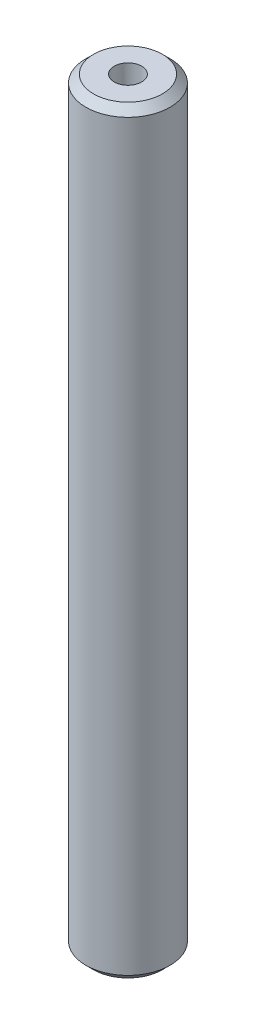
ISO-10303-21;
HEADER;
FILE_DESCRIPTION(('STEP AP214'),'2;1');
FILE_NAME('part.step','',(''),(''),'','','');
FILE_SCHEMA(('AUTOMOTIVE_DESIGN { 1 0 10303 214 1 1 1 1 }'));
ENDSEC;
DATA;
#1=APPLICATION_CONTEXT('core data for automotive mechanical design processes');
#2=APPLICATION_PROTOCOL_DEFINITION('international standard','automotive_design',2000,#1);
#3=PRODUCT_CONTEXT('',#1,'mechanical');
#4=PRODUCT('Part','Part','',(#3));
#5=PRODUCT_RELATED_PRODUCT_CATEGORY('part','',(#4));
#6=PRODUCT_DEFINITION_FORMATION('','',#4);
#7=PRODUCT_DEFINITION_CONTEXT('part definition',#1,'design');
#8=PRODUCT_DEFINITION('design','',#6,#7);
#9=PRODUCT_DEFINITION_SHAPE('','',#8);
#10=(LENGTH_UNIT() NAMED_UNIT(*) SI_UNIT(.MILLI.,.METRE.));
#11=(NAMED_UNIT(*) PLANE_ANGLE_UNIT() SI_UNIT($,.RADIAN.));
#12=(NAMED_UNIT(*) SI_UNIT($,.STERADIAN.) SOLID_ANGLE_UNIT());
#13=UNCERTAINTY_MEASURE_WITH_UNIT(LENGTH_MEASURE(1.E-05),#10,'distance_accuracy_value','');
#14=(GEOMETRIC_REPRESENTATION_CONTEXT(3) GLOBAL_UNCERTAINTY_ASSIGNED_CONTEXT((#13)) GLOBAL_UNIT_ASSIGNED_CONTEXT((#10,
#11,#12)) REPRESENTATION_CONTEXT('',''));
#15=CARTESIAN_POINT('',(0.,0.,0.));
#16=DIRECTION('',(0.,0.,1.));
#17=DIRECTION('',(1.,0.,0.));
#18=AXIS2_PLACEMENT_3D('',#15,#16,#17);
#19=CARTESIAN_POINT('',(0.,225.239247243365,0.));
#20=DIRECTION('',(0.,-1.,0.));
#21=DIRECTION('',(0.,0.,-1.));
#22=AXIS2_PLACEMENT_3D('',#19,#20,#21);
#23=CYLINDRICAL_SURFACE('',#22,12.5);
#24=CARTESIAN_POINT('',(0.,222.953174462364,0.));
#25=DIRECTION('',(0.,1.,0.));
#26=DIRECTION('',(0.,0.,1.));
#27=AXIS2_PLACEMENT_3D('',#24,#25,#26);
#28=CIRCLE('',#27,12.5);
#29=CARTESIAN_POINT('',(0.,222.953174462364,12.5));
#30=VERTEX_POINT('',#29);
#31=EDGE_CURVE('E50',#30,#30,#28,.F.);
#32=ORIENTED_EDGE('',*,*,#31,.T.);
#33=EDGE_LOOP('',(#32));
#34=FACE_BOUND('',#33,.T.);
#35=CARTESIAN_POINT('',(0.,2.28607278100065,0.));
#36=DIRECTION('',(0.,1.,0.));
#37=DIRECTION('',(0.,0.,1.));
#38=AXIS2_PLACEMENT_3D('',#35,#36,#37);
#39=CIRCLE('',#38,12.5);
#40=CARTESIAN_POINT('',(0.,2.28607278100065,12.5));
#41=VERTEX_POINT('',#40);
#42=EDGE_CURVE('E51',#41,#41,#39,.T.);
#43=ORIENTED_EDGE('',*,*,#42,.T.);
#44=EDGE_LOOP('',(#43));
#45=FACE_BOUND('',#44,.T.);
#46=ADVANCED_FACE('F39',(#34,#45),#23,.T.);
#47=CARTESIAN_POINT('',(0.,225.239247243365,0.));
#48=DIRECTION('',(0.,1.,0.));
#49=DIRECTION('',(0.,0.,1.));
#50=AXIS2_PLACEMENT_3D('',#47,#48,#49);
#51=PLANE('',#50);
#52=CARTESIAN_POINT('',(0.,225.239247243365,0.));
#53=DIRECTION('',(0.,1.,0.));
#54=DIRECTION('',(0.,0.,1.));
#55=AXIS2_PLACEMENT_3D('',#52,#53,#54);
#56=CIRCLE('',#55,10.2139272189993);
#57=CARTESIAN_POINT('',(0.,225.239247243365,10.2139272189993));
#58=VERTEX_POINT('',#57);
#59=EDGE_CURVE('E54',#58,#58,#56,.T.);
#60=ORIENTED_EDGE('',*,*,#59,.T.);
#61=EDGE_LOOP('',(#60));
#62=FACE_BOUND('',#61,.T.);
#63=CARTESIAN_POINT('',(0.,225.239247243365,0.));
#64=DIRECTION('',(0.,1.,0.));
#65=DIRECTION('',(0.,0.,1.));
#66=AXIS2_PLACEMENT_3D('',#63,#64,#65);
#67=CIRCLE('',#66,4.07792532446989);
#68=CARTESIAN_POINT('',(0.,225.239247243365,4.07792532446989));
#69=VERTEX_POINT('',#68);
#70=EDGE_CURVE('E58',#69,#69,#67,.T.);
#71=ORIENTED_EDGE('',*,*,#70,.F.);
#72=EDGE_LOOP('',(#71));
#73=FACE_BOUND('',#72,.T.);
#74=ADVANCED_FACE('F69',(#62,#73),#51,.T.);
#75=CARTESIAN_POINT('',(0.,0.,0.));
#76=DIRECTION('',(0.,1.,0.));
#77=DIRECTION('',(0.,0.,1.));
#78=AXIS2_PLACEMENT_3D('',#75,#76,#77);
#79=PLANE('',#78);
#80=CARTESIAN_POINT('',(0.,0.,0.));
#81=DIRECTION('',(0.,1.,0.));
#82=DIRECTION('',(0.,0.,1.));
#83=AXIS2_PLACEMENT_3D('',#80,#81,#82);
#84=CIRCLE('',#83,10.2139272189993);
#85=CARTESIAN_POINT('',(0.,0.,10.2139272189993));
#86=VERTEX_POINT('',#85);
#87=EDGE_CURVE('E10',#86,#86,#84,.F.);
#88=ORIENTED_EDGE('',*,*,#87,.T.);
#89=EDGE_LOOP('',(#88));
#90=FACE_BOUND('',#89,.T.);
#91=CARTESIAN_POINT('',(0.,0.,0.));
#92=DIRECTION('',(0.,1.,0.));
#93=DIRECTION('',(0.,0.,1.));
#94=AXIS2_PLACEMENT_3D('',#91,#92,#93);
#95=CIRCLE('',#94,4.07792532446989);
#96=CARTESIAN_POINT('',(0.,0.,4.07792532446989));
#97=VERTEX_POINT('',#96);
#98=EDGE_CURVE('E63',#97,#97,#95,.T.);
#99=ORIENTED_EDGE('',*,*,#98,.T.);
#100=EDGE_LOOP('',(#99));
#101=FACE_BOUND('',#100,.T.);
#102=ADVANCED_FACE('F75',(#90,#101),#79,.F.);
#103=CARTESIAN_POINT('',(0.,225.239247243365,0.));
#104=DIRECTION('',(0.,-1.,0.));
#105=DIRECTION('',(0.,0.,-1.));
#106=AXIS2_PLACEMENT_3D('',#103,#104,#105);
#107=CYLINDRICAL_SURFACE('',#106,4.07792532446989);
#108=ORIENTED_EDGE('',*,*,#70,.T.);
#109=EDGE_LOOP('',(#108));
#110=FACE_BOUND('',#109,.T.);
#111=ORIENTED_EDGE('',*,*,#98,.F.);
#112=EDGE_LOOP('',(#111));
#113=FACE_BOUND('',#112,.T.);
#114=ADVANCED_FACE('F70',(#110,#113),#107,.F.);
#115=CARTESIAN_POINT('',(0.,225.239247243365,0.));
#116=DIRECTION('',(0.,-1.,0.));
#117=DIRECTION('',(0.,0.,-1.));
#118=AXIS2_PLACEMENT_3D('',#115,#116,#117);
#119=CONICAL_SURFACE('',#118,10.2139272189993,0.785398163397446);
#120=ORIENTED_EDGE('',*,*,#31,.F.);
#121=EDGE_LOOP('',(#120));
#122=FACE_BOUND('',#121,.T.);
#123=ORIENTED_EDGE('',*,*,#59,.F.);
#124=EDGE_LOOP('',(#123));
#125=FACE_BOUND('',#124,.T.);
#126=ADVANCED_FACE('F81',(#122,#125),#119,.T.);
#127=CARTESIAN_POINT('',(0.,2.28607278100065,0.));
#128=DIRECTION('',(0.,1.,0.));
#129=DIRECTION('',(0.,0.,1.));
#130=AXIS2_PLACEMENT_3D('',#127,#128,#129);
#131=CONICAL_SURFACE('',#130,12.5,0.785398163397452);
#132=ORIENTED_EDGE('',*,*,#87,.F.);
#133=EDGE_LOOP('',(#132));
#134=FACE_BOUND('',#133,.T.);
#135=ORIENTED_EDGE('',*,*,#42,.F.);
#136=EDGE_LOOP('',(#135));
#137=FACE_BOUND('',#136,.T.);
#138=ADVANCED_FACE('F45',(#134,#137),#131,.T.);
#139=CLOSED_SHELL('',(#46,#74,#102,#114,#126,#138));
#140=MANIFOLD_SOLID_BREP('B2',#139);
#141=ADVANCED_BREP_SHAPE_REPRESENTATION('',(#18,#140),#14);
#142=SHAPE_DEFINITION_REPRESENTATION(#9,#141);
ENDSEC;
END-ISO-10303-21;
